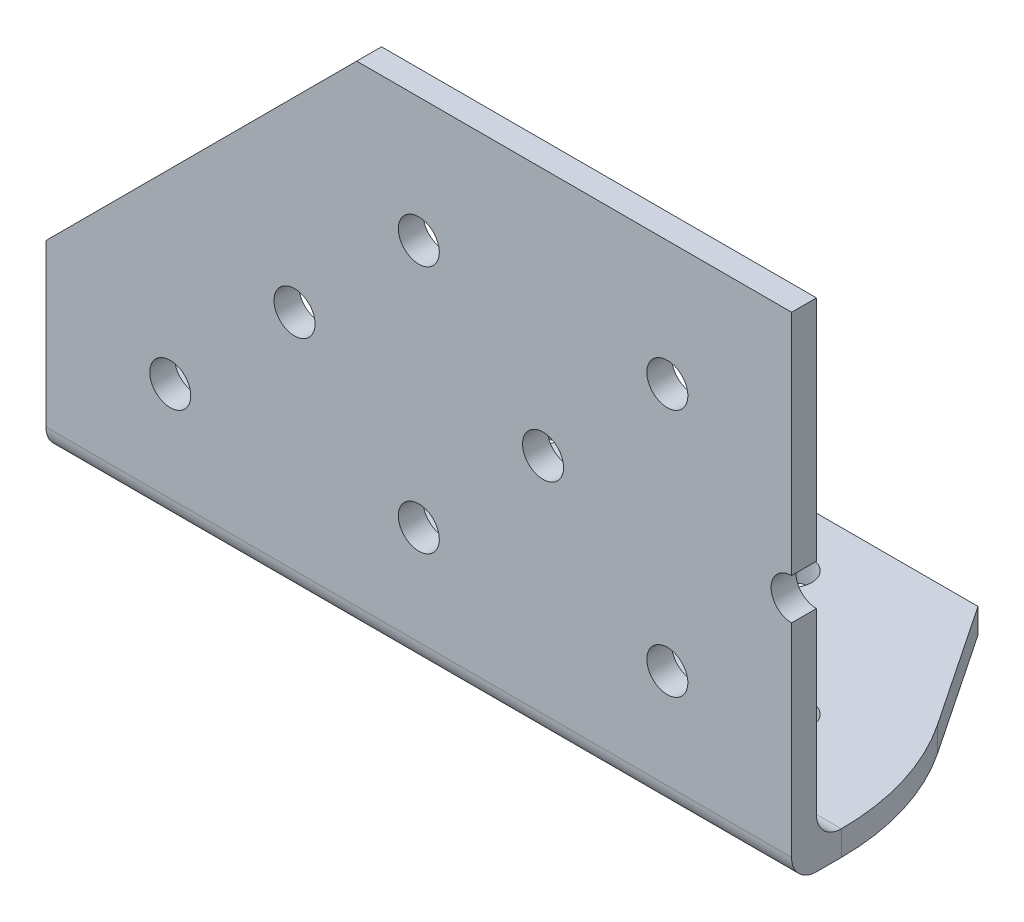
ISO-10303-21;
HEADER;
FILE_DESCRIPTION(('STEP AP214'),'2;1');
FILE_NAME('part.step','',(''),(''),'','','');
FILE_SCHEMA(('AUTOMOTIVE_DESIGN { 1 0 10303 214 1 1 1 1 }'));
ENDSEC;
DATA;
#1=APPLICATION_CONTEXT('core data for automotive mechanical design processes');
#2=APPLICATION_PROTOCOL_DEFINITION('international standard','automotive_design',2000,#1);
#3=PRODUCT_CONTEXT('',#1,'mechanical');
#4=PRODUCT('Part','Part','',(#3));
#5=PRODUCT_RELATED_PRODUCT_CATEGORY('part','',(#4));
#6=PRODUCT_DEFINITION_FORMATION('','',#4);
#7=PRODUCT_DEFINITION_CONTEXT('part definition',#1,'design');
#8=PRODUCT_DEFINITION('design','',#6,#7);
#9=PRODUCT_DEFINITION_SHAPE('','',#8);
#10=(LENGTH_UNIT() NAMED_UNIT(*) SI_UNIT(.MILLI.,.METRE.));
#11=(NAMED_UNIT(*) PLANE_ANGLE_UNIT() SI_UNIT($,.RADIAN.));
#12=(NAMED_UNIT(*) SI_UNIT($,.STERADIAN.) SOLID_ANGLE_UNIT());
#13=UNCERTAINTY_MEASURE_WITH_UNIT(LENGTH_MEASURE(1.E-05),#10,'distance_accuracy_value','');
#14=(GEOMETRIC_REPRESENTATION_CONTEXT(3) GLOBAL_UNCERTAINTY_ASSIGNED_CONTEXT((#13)) GLOBAL_UNIT_ASSIGNED_CONTEXT((#10,
#11,#12)) REPRESENTATION_CONTEXT('',''));
#15=CARTESIAN_POINT('',(0.,0.,0.));
#16=DIRECTION('',(0.,0.,1.));
#17=DIRECTION('',(1.,0.,0.));
#18=AXIS2_PLACEMENT_3D('',#15,#16,#17);
#19=CARTESIAN_POINT('',(0.,5.07999999999997,-5.08000000000003));
#20=DIRECTION('',(-1.,0.,0.));
#21=DIRECTION('',(0.,0.,1.));
#22=AXIS2_PLACEMENT_3D('',#19,#20,#21);
#23=PLANE('',#22);
#24=CARTESIAN_POINT('',(0.,5.07999999999997,-5.08000000000003));
#25=DIRECTION('',(-1.,0.,0.));
#26=DIRECTION('',(0.,0.,1.));
#27=AXIS2_PLACEMENT_3D('',#24,#25,#26);
#28=CIRCLE('',#27,2.54);
#29=CARTESIAN_POINT('',(0.,2.53999999999997,-5.08000000000004));
#30=VERTEX_POINT('',#29);
#31=CARTESIAN_POINT('',(0.,5.07999999999997,-2.54000000000003));
#32=VERTEX_POINT('',#31);
#33=EDGE_CURVE('E152',#30,#32,#28,.T.);
#34=ORIENTED_EDGE('',*,*,#33,.F.);
#35=DIRECTION('',(0.,1.,0.));
#36=VECTOR('',#35,1.);
#37=CARTESIAN_POINT('',(0.,0.,-5.08000000000004));
#38=LINE('',#37,#36);
#39=CARTESIAN_POINT('',(0.,0.,-5.08000000000004));
#40=VERTEX_POINT('',#39);
#41=EDGE_CURVE('E139',#40,#30,#38,.T.);
#42=ORIENTED_EDGE('',*,*,#41,.F.);
#43=DIRECTION('',(0.,0.,-1.));
#44=VECTOR('',#43,1.);
#45=CARTESIAN_POINT('',(0.,0.,-50.8));
#46=LINE('',#45,#44);
#47=CARTESIAN_POINT('',(0.,0.,-2.54000000000001));
#48=VERTEX_POINT('',#47);
#49=EDGE_CURVE('E150',#48,#40,#46,.T.);
#50=ORIENTED_EDGE('',*,*,#49,.F.);
#51=CARTESIAN_POINT('',(0.,2.54,-2.54));
#52=DIRECTION('',(1.,0.,0.));
#53=DIRECTION('',(0.,0.,-1.));
#54=AXIS2_PLACEMENT_3D('',#51,#52,#53);
#55=CIRCLE('',#54,2.54);
#56=CARTESIAN_POINT('',(0.,2.54000000000002,0.));
#57=VERTEX_POINT('',#56);
#58=EDGE_CURVE('E159',#57,#48,#55,.T.);
#59=ORIENTED_EDGE('',*,*,#58,.F.);
#60=DIRECTION('',(0.,-1.,0.));
#61=VECTOR('',#60,1.);
#62=CARTESIAN_POINT('',(0.,2.54000000000002,0.));
#63=LINE('',#62,#61);
#64=CARTESIAN_POINT('',(0.,19.05,0.));
#65=VERTEX_POINT('',#64);
#66=EDGE_CURVE('E163',#65,#57,#63,.T.);
#67=ORIENTED_EDGE('',*,*,#66,.F.);
#68=DIRECTION('',(0.,0.,-1.));
#69=VECTOR('',#68,1.);
#70=CARTESIAN_POINT('',(0.,19.05,0.));
#71=LINE('',#70,#69);
#72=CARTESIAN_POINT('',(0.,19.05,-2.54000000000003));
#73=VERTEX_POINT('',#72);
#74=EDGE_CURVE('E202',#65,#73,#71,.T.);
#75=ORIENTED_EDGE('',*,*,#74,.T.);
#76=DIRECTION('',(0.,1.,0.));
#77=VECTOR('',#76,1.);
#78=CARTESIAN_POINT('',(0.,50.8,-2.54000000000002));
#79=LINE('',#78,#77);
#80=EDGE_CURVE('E161',#32,#73,#79,.T.);
#81=ORIENTED_EDGE('',*,*,#80,.F.);
#82=EDGE_LOOP('',(#34,#42,#50,#59,#67,#75,#81));
#83=FACE_BOUND('',#82,.T.);
#84=ADVANCED_FACE('F33',(#83),#23,.T.);
#85=CARTESIAN_POINT('',(76.2,5.07999999999997,-5.08000000000003));
#86=DIRECTION('',(-1.,0.,0.));
#87=DIRECTION('',(0.,0.,1.));
#88=AXIS2_PLACEMENT_3D('',#85,#86,#87);
#89=PLANE('',#88);
#90=DIRECTION('',(0.,1.,0.));
#91=VECTOR('',#90,1.);
#92=CARTESIAN_POINT('',(76.2,0.,-5.08000000000005));
#93=LINE('',#92,#91);
#94=CARTESIAN_POINT('',(76.2,0.,-5.08000000000005));
#95=VERTEX_POINT('',#94);
#96=CARTESIAN_POINT('',(76.2,2.53999999999997,-5.08000000000005));
#97=VERTEX_POINT('',#96);
#98=EDGE_CURVE('E328',#95,#97,#93,.T.);
#99=ORIENTED_EDGE('',*,*,#98,.T.);
#100=CARTESIAN_POINT('',(76.2,5.07999999999997,-5.08000000000003));
#101=DIRECTION('',(-1.,0.,0.));
#102=DIRECTION('',(0.,0.,1.));
#103=AXIS2_PLACEMENT_3D('',#100,#101,#102);
#104=CIRCLE('',#103,2.54);
#105=CARTESIAN_POINT('',(76.2,5.07999999999997,-2.54000000000003));
#106=VERTEX_POINT('',#105);
#107=EDGE_CURVE('E300',#97,#106,#104,.T.);
#108=ORIENTED_EDGE('',*,*,#107,.T.);
#109=DIRECTION('',(0.,1.,0.));
#110=VECTOR('',#109,1.);
#111=CARTESIAN_POINT('',(76.2,50.8,-2.54000000000002));
#112=LINE('',#111,#110);
#113=CARTESIAN_POINT('',(76.2,23.3045,-2.54000000000003));
#114=VERTEX_POINT('',#113);
#115=EDGE_CURVE('E174',#106,#114,#112,.T.);
#116=ORIENTED_EDGE('',*,*,#115,.T.);
#117=DIRECTION('',(0.,0.,-1.));
#118=VECTOR('',#117,1.);
#119=CARTESIAN_POINT('',(76.2,23.3045,0.));
#120=LINE('',#119,#118);
#121=CARTESIAN_POINT('',(76.2,23.3045,0.));
#122=VERTEX_POINT('',#121);
#123=EDGE_CURVE('E216',#114,#122,#120,.F.);
#124=ORIENTED_EDGE('',*,*,#123,.T.);
#125=DIRECTION('',(0.,-1.,0.));
#126=VECTOR('',#125,1.);
#127=CARTESIAN_POINT('',(76.2,2.54000000000002,0.));
#128=LINE('',#127,#126);
#129=CARTESIAN_POINT('',(76.2,2.54000000000002,0.));
#130=VERTEX_POINT('',#129);
#131=EDGE_CURVE('E293',#122,#130,#128,.T.);
#132=ORIENTED_EDGE('',*,*,#131,.T.);
#133=CARTESIAN_POINT('',(76.2,2.54,-2.54));
#134=DIRECTION('',(1.,0.,0.));
#135=DIRECTION('',(0.,0.,-1.));
#136=AXIS2_PLACEMENT_3D('',#133,#134,#135);
#137=CIRCLE('',#136,2.54);
#138=CARTESIAN_POINT('',(76.2,0.,-2.54000000000001));
#139=VERTEX_POINT('',#138);
#140=EDGE_CURVE('E295',#130,#139,#137,.T.);
#141=ORIENTED_EDGE('',*,*,#140,.T.);
#142=DIRECTION('',(0.,0.,-1.));
#143=VECTOR('',#142,1.);
#144=CARTESIAN_POINT('',(76.2,0.,-50.8));
#145=LINE('',#144,#143);
#146=EDGE_CURVE('E297',#139,#95,#145,.T.);
#147=ORIENTED_EDGE('',*,*,#146,.T.);
#148=EDGE_LOOP('',(#99,#108,#116,#124,#132,#141,#147));
#149=FACE_BOUND('',#148,.T.);
#150=ADVANCED_FACE('F311',(#149),#89,.F.);
#151=CARTESIAN_POINT('',(76.2,50.8,0.));
#152=VERTEX_POINT('',#151);
#153=CARTESIAN_POINT('',(76.2,27.4955,0.));
#154=VERTEX_POINT('',#153);
#155=EDGE_CURVE('E192',#152,#154,#128,.T.);
#156=ORIENTED_EDGE('',*,*,#155,.T.);
#157=DIRECTION('',(0.,0.,-1.));
#158=VECTOR('',#157,1.);
#159=CARTESIAN_POINT('',(76.2,27.4955,0.));
#160=LINE('',#159,#158);
#161=CARTESIAN_POINT('',(76.2,27.4955,-2.54000000000003));
#162=VERTEX_POINT('',#161);
#163=EDGE_CURVE('E241',#154,#162,#160,.T.);
#164=ORIENTED_EDGE('',*,*,#163,.T.);
#165=CARTESIAN_POINT('',(76.2,50.8,-2.54000000000002));
#166=VERTEX_POINT('',#165);
#167=EDGE_CURVE('E302',#162,#166,#112,.T.);
#168=ORIENTED_EDGE('',*,*,#167,.T.);
#169=DIRECTION('',(0.,0.,1.));
#170=VECTOR('',#169,1.);
#171=CARTESIAN_POINT('',(76.2,50.8,0.));
#172=LINE('',#171,#170);
#173=EDGE_CURVE('E169',#166,#152,#172,.T.);
#174=ORIENTED_EDGE('',*,*,#173,.T.);
#175=EDGE_LOOP('',(#156,#164,#168,#174));
#176=FACE_BOUND('',#175,.T.);
#177=ADVANCED_FACE('F314',(#176),#89,.F.);
#178=CARTESIAN_POINT('',(76.2,50.8,0.));
#179=DIRECTION('',(0.,-1.,0.));
#180=DIRECTION('',(0.,0.,-1.));
#181=AXIS2_PLACEMENT_3D('',#178,#179,#180);
#182=PLANE('',#181);
#183=DIRECTION('',(-1.,0.,0.));
#184=VECTOR('',#183,1.);
#185=CARTESIAN_POINT('',(76.2,50.8,-2.54000000000002));
#186=LINE('',#185,#184);
#187=CARTESIAN_POINT('',(31.75,50.8,-2.54000000000002));
#188=VERTEX_POINT('',#187);
#189=EDGE_CURVE('E170',#166,#188,#186,.T.);
#190=ORIENTED_EDGE('',*,*,#189,.T.);
#191=DIRECTION('',(0.,0.,-1.));
#192=VECTOR('',#191,1.);
#193=CARTESIAN_POINT('',(31.75,50.8,0.));
#194=LINE('',#193,#192);
#195=CARTESIAN_POINT('',(31.75,50.8,0.));
#196=VERTEX_POINT('',#195);
#197=EDGE_CURVE('E197',#196,#188,#194,.T.);
#198=ORIENTED_EDGE('',*,*,#197,.F.);
#199=DIRECTION('',(-1.,0.,0.));
#200=VECTOR('',#199,1.);
#201=CARTESIAN_POINT('',(76.2,50.8,0.));
#202=LINE('',#201,#200);
#203=EDGE_CURVE('E41',#152,#196,#202,.T.);
#204=ORIENTED_EDGE('',*,*,#203,.F.);
#205=ORIENTED_EDGE('',*,*,#173,.F.);
#206=EDGE_LOOP('',(#190,#198,#204,#205));
#207=FACE_BOUND('',#206,.T.);
#208=ADVANCED_FACE('F35',(#207),#182,.F.);
#209=CARTESIAN_POINT('',(76.2,2.54000000000002,0.));
#210=DIRECTION('',(0.,0.,-1.));
#211=DIRECTION('',(-1.,0.,0.));
#212=AXIS2_PLACEMENT_3D('',#209,#210,#211);
#213=PLANE('',#212);
#214=CARTESIAN_POINT('',(38.1,12.7,0.));
#215=DIRECTION('',(0.,0.,-1.));
#216=DIRECTION('',(0.,1.,0.));
#217=AXIS2_PLACEMENT_3D('',#214,#215,#216);
#218=CIRCLE('',#217,2.0955);
#219=CARTESIAN_POINT('',(38.1,14.7955,0.));
#220=VERTEX_POINT('',#219);
#221=EDGE_CURVE('E213',#220,#220,#218,.T.);
#222=ORIENTED_EDGE('',*,*,#221,.T.);
#223=EDGE_LOOP('',(#222));
#224=FACE_BOUND('',#223,.T.);
#225=CARTESIAN_POINT('',(50.8,25.4,0.));
#226=DIRECTION('',(0.,0.,-1.));
#227=DIRECTION('',(0.,1.,0.));
#228=AXIS2_PLACEMENT_3D('',#225,#226,#227);
#229=CIRCLE('',#228,2.0955);
#230=CARTESIAN_POINT('',(50.8,27.4955,0.));
#231=VERTEX_POINT('',#230);
#232=EDGE_CURVE('E220',#231,#231,#229,.T.);
#233=ORIENTED_EDGE('',*,*,#232,.T.);
#234=EDGE_LOOP('',(#233));
#235=FACE_BOUND('',#234,.T.);
#236=CARTESIAN_POINT('',(63.5,38.1,0.));
#237=DIRECTION('',(0.,0.,-1.));
#238=DIRECTION('',(0.,1.,0.));
#239=AXIS2_PLACEMENT_3D('',#236,#237,#238);
#240=CIRCLE('',#239,2.0955);
#241=CARTESIAN_POINT('',(63.5,40.1955,0.));
#242=VERTEX_POINT('',#241);
#243=EDGE_CURVE('E226',#242,#242,#240,.T.);
#244=ORIENTED_EDGE('',*,*,#243,.T.);
#245=EDGE_LOOP('',(#244));
#246=FACE_BOUND('',#245,.T.);
#247=CARTESIAN_POINT('',(63.5,12.7,0.));
#248=DIRECTION('',(0.,0.,-1.));
#249=DIRECTION('',(0.,1.,0.));
#250=AXIS2_PLACEMENT_3D('',#247,#248,#249);
#251=CIRCLE('',#250,2.0955);
#252=CARTESIAN_POINT('',(63.5,14.7955,0.));
#253=VERTEX_POINT('',#252);
#254=EDGE_CURVE('E232',#253,#253,#251,.T.);
#255=ORIENTED_EDGE('',*,*,#254,.T.);
#256=EDGE_LOOP('',(#255));
#257=FACE_BOUND('',#256,.T.);
#258=CARTESIAN_POINT('',(38.1,38.1,0.));
#259=DIRECTION('',(0.,0.,-1.));
#260=DIRECTION('',(0.,1.,0.));
#261=AXIS2_PLACEMENT_3D('',#258,#259,#260);
#262=CIRCLE('',#261,2.0955);
#263=CARTESIAN_POINT('',(38.1,40.1955,0.));
#264=VERTEX_POINT('',#263);
#265=EDGE_CURVE('E245',#264,#264,#262,.T.);
#266=ORIENTED_EDGE('',*,*,#265,.T.);
#267=EDGE_LOOP('',(#266));
#268=FACE_BOUND('',#267,.T.);
#269=CARTESIAN_POINT('',(12.7,12.7,0.));
#270=DIRECTION('',(0.,0.,-1.));
#271=DIRECTION('',(0.,1.,0.));
#272=AXIS2_PLACEMENT_3D('',#269,#270,#271);
#273=CIRCLE('',#272,2.0955);
#274=CARTESIAN_POINT('',(12.7,14.7955,0.));
#275=VERTEX_POINT('',#274);
#276=EDGE_CURVE('E251',#275,#275,#273,.T.);
#277=ORIENTED_EDGE('',*,*,#276,.T.);
#278=EDGE_LOOP('',(#277));
#279=FACE_BOUND('',#278,.T.);
#280=CARTESIAN_POINT('',(25.4,25.4,0.));
#281=DIRECTION('',(0.,0.,-1.));
#282=DIRECTION('',(0.,1.,0.));
#283=AXIS2_PLACEMENT_3D('',#280,#281,#282);
#284=CIRCLE('',#283,2.0955);
#285=CARTESIAN_POINT('',(25.4,27.4955,0.));
#286=VERTEX_POINT('',#285);
#287=EDGE_CURVE('E258',#286,#286,#284,.T.);
#288=ORIENTED_EDGE('',*,*,#287,.T.);
#289=EDGE_LOOP('',(#288));
#290=FACE_BOUND('',#289,.T.);
#291=ORIENTED_EDGE('',*,*,#203,.T.);
#292=DIRECTION('',(-0.707106781186547,-0.707106781186548,0.));
#293=VECTOR('',#292,1.);
#294=CARTESIAN_POINT('',(0.,19.05,0.));
#295=LINE('',#294,#293);
#296=EDGE_CURVE('E188',#196,#65,#295,.T.);
#297=ORIENTED_EDGE('',*,*,#296,.T.);
#298=ORIENTED_EDGE('',*,*,#66,.T.);
#299=DIRECTION('',(-1.,0.,0.));
#300=VECTOR('',#299,1.);
#301=CARTESIAN_POINT('',(76.2,2.54000000000002,0.));
#302=LINE('',#301,#300);
#303=EDGE_CURVE('E181',#130,#57,#302,.T.);
#304=ORIENTED_EDGE('',*,*,#303,.F.);
#305=ORIENTED_EDGE('',*,*,#131,.F.);
#306=CARTESIAN_POINT('',(76.2,25.4,0.));
#307=DIRECTION('',(0.,0.,-1.));
#308=DIRECTION('',(0.,1.,0.));
#309=AXIS2_PLACEMENT_3D('',#306,#307,#308);
#310=CIRCLE('',#309,2.0955);
#311=EDGE_CURVE('E211',#122,#154,#310,.T.);
#312=ORIENTED_EDGE('',*,*,#311,.T.);
#313=ORIENTED_EDGE('',*,*,#155,.F.);
#314=EDGE_LOOP('',(#291,#297,#298,#304,#305,#312,#313));
#315=FACE_BOUND('',#314,.T.);
#316=ADVANCED_FACE('F187',(#224,#235,#246,#257,#268,#279,#290,#315),#213,.F.);
#317=CARTESIAN_POINT('',(76.2,2.54,-2.54));
#318=DIRECTION('',(-1.,0.,0.));
#319=DIRECTION('',(0.,0.,1.));
#320=AXIS2_PLACEMENT_3D('',#317,#318,#319);
#321=CYLINDRICAL_SURFACE('',#320,2.54);
#322=ORIENTED_EDGE('',*,*,#58,.T.);
#323=DIRECTION('',(-1.,0.,0.));
#324=VECTOR('',#323,1.);
#325=CARTESIAN_POINT('',(76.2,0.,-2.54000000000001));
#326=LINE('',#325,#324);
#327=EDGE_CURVE('E158',#139,#48,#326,.T.);
#328=ORIENTED_EDGE('',*,*,#327,.F.);
#329=ORIENTED_EDGE('',*,*,#140,.F.);
#330=ORIENTED_EDGE('',*,*,#303,.T.);
#331=EDGE_LOOP('',(#322,#328,#329,#330));
#332=FACE_BOUND('',#331,.T.);
#333=ADVANCED_FACE('F308',(#332),#321,.T.);
#334=CARTESIAN_POINT('',(76.2,0.,-50.8));
#335=DIRECTION('',(0.,1.,0.));
#336=DIRECTION('',(0.,0.,1.));
#337=AXIS2_PLACEMENT_3D('',#334,#335,#336);
#338=PLANE('',#337);
#339=CARTESIAN_POINT('',(38.1,0.,-12.6619));
#340=DIRECTION('',(0.,1.,0.));
#341=DIRECTION('',(0.,0.,1.));
#342=AXIS2_PLACEMENT_3D('',#339,#340,#341);
#343=CIRCLE('',#342,2.0955);
#344=CARTESIAN_POINT('',(38.1,0.,-10.5664));
#345=VERTEX_POINT('',#344);
#346=EDGE_CURVE('E263',#345,#345,#343,.T.);
#347=ORIENTED_EDGE('',*,*,#346,.T.);
#348=EDGE_LOOP('',(#347));
#349=FACE_BOUND('',#348,.T.);
#350=CARTESIAN_POINT('',(50.8,0.,-25.3619));
#351=DIRECTION('',(0.,1.,0.));
#352=DIRECTION('',(0.,0.,1.));
#353=AXIS2_PLACEMENT_3D('',#350,#351,#352);
#354=CIRCLE('',#353,2.0955);
#355=CARTESIAN_POINT('',(50.8,0.,-23.2664));
#356=VERTEX_POINT('',#355);
#357=EDGE_CURVE('E270',#356,#356,#354,.T.);
#358=ORIENTED_EDGE('',*,*,#357,.T.);
#359=EDGE_LOOP('',(#358));
#360=FACE_BOUND('',#359,.T.);
#361=CARTESIAN_POINT('',(63.5,0.,-12.6619));
#362=DIRECTION('',(0.,1.,0.));
#363=DIRECTION('',(0.,0.,1.));
#364=AXIS2_PLACEMENT_3D('',#361,#362,#363);
#365=CIRCLE('',#364,2.0955);
#366=CARTESIAN_POINT('',(63.5,0.,-10.5664));
#367=VERTEX_POINT('',#366);
#368=EDGE_CURVE('E276',#367,#367,#365,.T.);
#369=ORIENTED_EDGE('',*,*,#368,.T.);
#370=EDGE_LOOP('',(#369));
#371=FACE_BOUND('',#370,.T.);
#372=CARTESIAN_POINT('',(12.7,0.,-12.6619));
#373=DIRECTION('',(0.,1.,0.));
#374=DIRECTION('',(0.,0.,1.));
#375=AXIS2_PLACEMENT_3D('',#372,#373,#374);
#376=CIRCLE('',#375,2.0955);
#377=CARTESIAN_POINT('',(12.7,0.,-10.5664));
#378=VERTEX_POINT('',#377);
#379=EDGE_CURVE('E281',#378,#378,#376,.T.);
#380=ORIENTED_EDGE('',*,*,#379,.T.);
#381=EDGE_LOOP('',(#380));
#382=FACE_BOUND('',#381,.T.);
#383=CARTESIAN_POINT('',(25.4,0.,-25.3619));
#384=DIRECTION('',(0.,1.,0.));
#385=DIRECTION('',(0.,0.,1.));
#386=AXIS2_PLACEMENT_3D('',#383,#384,#385);
#387=CIRCLE('',#386,2.0955);
#388=CARTESIAN_POINT('',(25.4,0.,-23.2664));
#389=VERTEX_POINT('',#388);
#390=EDGE_CURVE('E287',#389,#389,#387,.T.);
#391=ORIENTED_EDGE('',*,*,#390,.T.);
#392=EDGE_LOOP('',(#391));
#393=FACE_BOUND('',#392,.T.);
#394=CARTESIAN_POINT('',(25.4,0.,-5.08000000000005));
#395=DIRECTION('',(0.,-1.,0.));
#396=DIRECTION('',(0.,0.,-1.));
#397=AXIS2_PLACEMENT_3D('',#394,#395,#396);
#398=CIRCLE('',#397,25.4);
#399=CARTESIAN_POINT('',(4.3024508886765,0.,-19.2240242327032));
#400=VERTEX_POINT('',#399);
#401=EDGE_CURVE('E136',#40,#400,#398,.T.);
#402=ORIENTED_EDGE('',*,*,#401,.T.);
#403=DIRECTION('',(0.556851347744217,0.,-0.830612169737146));
#404=VECTOR('',#403,1.);
#405=CARTESIAN_POINT('',(12.7,0.,-31.75));
#406=LINE('',#405,#404);
#407=CARTESIAN_POINT('',(12.7,0.,-31.75));
#408=VERTEX_POINT('',#407);
#409=EDGE_CURVE('E144',#400,#408,#406,.T.);
#410=ORIENTED_EDGE('',*,*,#409,.T.);
#411=DIRECTION('',(1.,0.,0.));
#412=VECTOR('',#411,1.);
#413=CARTESIAN_POINT('',(76.2,0.,-31.75));
#414=LINE('',#413,#412);
#415=CARTESIAN_POINT('',(63.5,0.,-31.75));
#416=VERTEX_POINT('',#415);
#417=EDGE_CURVE('E56',#408,#416,#414,.T.);
#418=ORIENTED_EDGE('',*,*,#417,.T.);
#419=DIRECTION('',(0.556851347744217,0.,0.830612169737146));
#420=VECTOR('',#419,1.);
#421=CARTESIAN_POINT('',(63.5,0.,-31.75));
#422=LINE('',#421,#420);
#423=CARTESIAN_POINT('',(71.8975491113235,0.,-19.2240242327031));
#424=VERTEX_POINT('',#423);
#425=EDGE_CURVE('E331',#416,#424,#422,.T.);
#426=ORIENTED_EDGE('',*,*,#425,.T.);
#427=CARTESIAN_POINT('',(50.8,0.,-5.08000000000005));
#428=DIRECTION('',(0.,-1.,0.));
#429=DIRECTION('',(0.,0.,1.));
#430=AXIS2_PLACEMENT_3D('',#427,#428,#429);
#431=CIRCLE('',#430,25.4);
#432=EDGE_CURVE('E337',#424,#95,#431,.T.);
#433=ORIENTED_EDGE('',*,*,#432,.T.);
#434=ORIENTED_EDGE('',*,*,#146,.F.);
#435=ORIENTED_EDGE('',*,*,#327,.T.);
#436=ORIENTED_EDGE('',*,*,#49,.T.);
#437=EDGE_LOOP('',(#402,#410,#418,#426,#433,#434,#435,#436));
#438=FACE_BOUND('',#437,.T.);
#439=ADVANCED_FACE('F155',(#349,#360,#371,#382,#393,#438),#338,.F.);
#440=CARTESIAN_POINT('',(76.2,2.53999999999997,-5.08000000000005));
#441=DIRECTION('',(0.,-1.,0.));
#442=DIRECTION('',(0.,0.,-1.));
#443=AXIS2_PLACEMENT_3D('',#440,#441,#442);
#444=PLANE('',#443);
#445=CARTESIAN_POINT('',(38.1,2.53999999999997,-12.6619));
#446=DIRECTION('',(0.,1.,0.));
#447=DIRECTION('',(0.,0.,1.));
#448=AXIS2_PLACEMENT_3D('',#445,#446,#447);
#449=CIRCLE('',#448,2.0955);
#450=CARTESIAN_POINT('',(38.1,2.53999999999997,-10.5664));
#451=VERTEX_POINT('',#450);
#452=EDGE_CURVE('E267',#451,#451,#449,.T.);
#453=ORIENTED_EDGE('',*,*,#452,.F.);
#454=EDGE_LOOP('',(#453));
#455=FACE_BOUND('',#454,.T.);
#456=CARTESIAN_POINT('',(50.8,2.53999999999997,-25.3619));
#457=DIRECTION('',(0.,1.,0.));
#458=DIRECTION('',(0.,0.,1.));
#459=AXIS2_PLACEMENT_3D('',#456,#457,#458);
#460=CIRCLE('',#459,2.0955);
#461=CARTESIAN_POINT('',(50.8,2.53999999999997,-23.2664));
#462=VERTEX_POINT('',#461);
#463=EDGE_CURVE('E273',#462,#462,#460,.T.);
#464=ORIENTED_EDGE('',*,*,#463,.F.);
#465=EDGE_LOOP('',(#464));
#466=FACE_BOUND('',#465,.T.);
#467=CARTESIAN_POINT('',(63.5,2.53999999999997,-12.6619));
#468=DIRECTION('',(0.,1.,0.));
#469=DIRECTION('',(0.,0.,1.));
#470=AXIS2_PLACEMENT_3D('',#467,#468,#469);
#471=CIRCLE('',#470,2.0955);
#472=CARTESIAN_POINT('',(63.5,2.53999999999997,-10.5664));
#473=VERTEX_POINT('',#472);
#474=EDGE_CURVE('E254',#473,#473,#471,.T.);
#475=ORIENTED_EDGE('',*,*,#474,.F.);
#476=EDGE_LOOP('',(#475));
#477=FACE_BOUND('',#476,.T.);
#478=CARTESIAN_POINT('',(12.7,2.53999999999997,-12.6619));
#479=DIRECTION('',(0.,1.,0.));
#480=DIRECTION('',(0.,0.,1.));
#481=AXIS2_PLACEMENT_3D('',#478,#479,#480);
#482=CIRCLE('',#481,2.0955);
#483=CARTESIAN_POINT('',(12.7,2.53999999999997,-10.5664));
#484=VERTEX_POINT('',#483);
#485=EDGE_CURVE('E284',#484,#484,#482,.T.);
#486=ORIENTED_EDGE('',*,*,#485,.F.);
#487=EDGE_LOOP('',(#486));
#488=FACE_BOUND('',#487,.T.);
#489=CARTESIAN_POINT('',(25.4,2.53999999999997,-25.3619));
#490=DIRECTION('',(0.,1.,0.));
#491=DIRECTION('',(0.,0.,1.));
#492=AXIS2_PLACEMENT_3D('',#489,#490,#491);
#493=CIRCLE('',#492,2.0955);
#494=CARTESIAN_POINT('',(25.4,2.53999999999997,-23.2664));
#495=VERTEX_POINT('',#494);
#496=EDGE_CURVE('E266',#495,#495,#493,.T.);
#497=ORIENTED_EDGE('',*,*,#496,.F.);
#498=EDGE_LOOP('',(#497));
#499=FACE_BOUND('',#498,.T.);
#500=DIRECTION('',(1.,0.,0.));
#501=VECTOR('',#500,1.);
#502=CARTESIAN_POINT('',(76.2,2.53999999999997,-31.75));
#503=LINE('',#502,#501);
#504=CARTESIAN_POINT('',(12.7,2.53999999999997,-31.75));
#505=VERTEX_POINT('',#504);
#506=CARTESIAN_POINT('',(63.5,2.53999999999997,-31.75));
#507=VERTEX_POINT('',#506);
#508=EDGE_CURVE('E201',#505,#507,#503,.T.);
#509=ORIENTED_EDGE('',*,*,#508,.F.);
#510=DIRECTION('',(-0.556851347744217,0.,0.830612169737146));
#511=VECTOR('',#510,1.);
#512=CARTESIAN_POINT('',(20.0546888016917,2.53999999999997,-42.7204215461838));
#513=LINE('',#512,#511);
#514=CARTESIAN_POINT('',(4.3024508886765,2.53999999999997,-19.2240242327032));
#515=VERTEX_POINT('',#514);
#516=EDGE_CURVE('E48',#505,#515,#513,.T.);
#517=ORIENTED_EDGE('',*,*,#516,.T.);
#518=CARTESIAN_POINT('',(25.4,2.53999999999997,-5.08000000000005));
#519=DIRECTION('',(0.,-1.,0.));
#520=DIRECTION('',(0.,0.,-1.));
#521=AXIS2_PLACEMENT_3D('',#518,#519,#520);
#522=CIRCLE('',#521,25.4);
#523=EDGE_CURVE('E340',#515,#30,#522,.F.);
#524=ORIENTED_EDGE('',*,*,#523,.T.);
#525=DIRECTION('',(-1.,0.,0.));
#526=VECTOR('',#525,1.);
#527=CARTESIAN_POINT('',(76.2,2.53999999999997,-5.08000000000005));
#528=LINE('',#527,#526);
#529=EDGE_CURVE('E177',#97,#30,#528,.T.);
#530=ORIENTED_EDGE('',*,*,#529,.F.);
#531=CARTESIAN_POINT('',(50.8,2.53999999999997,-5.08000000000005));
#532=DIRECTION('',(0.,-1.,0.));
#533=DIRECTION('',(0.,0.,-1.));
#534=AXIS2_PLACEMENT_3D('',#531,#532,#533);
#535=CIRCLE('',#534,25.4);
#536=CARTESIAN_POINT('',(71.8975491113235,2.53999999999997,-19.2240242327031));
#537=VERTEX_POINT('',#536);
#538=EDGE_CURVE('E318',#97,#537,#535,.F.);
#539=ORIENTED_EDGE('',*,*,#538,.T.);
#540=DIRECTION('',(-0.556851347744217,0.,-0.830612169737146));
#541=VECTOR('',#540,1.);
#542=CARTESIAN_POINT('',(79.7736680678311,2.53999999999997,-7.47582557596284));
#543=LINE('',#542,#541);
#544=EDGE_CURVE('E320',#537,#507,#543,.T.);
#545=ORIENTED_EDGE('',*,*,#544,.T.);
#546=EDGE_LOOP('',(#509,#517,#524,#530,#539,#545));
#547=FACE_BOUND('',#546,.T.);
#548=ADVANCED_FACE('F352',(#455,#466,#477,#488,#499,#547),#444,.F.);
#549=CARTESIAN_POINT('',(76.2,5.07999999999997,-5.08000000000003));
#550=DIRECTION('',(-1.,0.,0.));
#551=DIRECTION('',(0.,0.,1.));
#552=AXIS2_PLACEMENT_3D('',#549,#550,#551);
#553=CYLINDRICAL_SURFACE('',#552,2.54);
#554=ORIENTED_EDGE('',*,*,#33,.T.);
#555=DIRECTION('',(-1.,0.,0.));
#556=VECTOR('',#555,1.);
#557=CARTESIAN_POINT('',(76.2,5.07999999999997,-2.54000000000003));
#558=LINE('',#557,#556);
#559=EDGE_CURVE('E173',#106,#32,#558,.T.);
#560=ORIENTED_EDGE('',*,*,#559,.F.);
#561=ORIENTED_EDGE('',*,*,#107,.F.);
#562=ORIENTED_EDGE('',*,*,#529,.T.);
#563=EDGE_LOOP('',(#554,#560,#561,#562));
#564=FACE_BOUND('',#563,.T.);
#565=ADVANCED_FACE('F355',(#564),#553,.F.);
#566=CARTESIAN_POINT('',(76.2,50.8,-2.54000000000002));
#567=DIRECTION('',(0.,0.,1.));
#568=DIRECTION('',(0.,-1.,0.));
#569=AXIS2_PLACEMENT_3D('',#566,#567,#568);
#570=PLANE('',#569);
#571=CARTESIAN_POINT('',(38.1,12.7,-2.54000000000003));
#572=DIRECTION('',(0.,0.,-1.));
#573=DIRECTION('',(0.,1.,0.));
#574=AXIS2_PLACEMENT_3D('',#571,#572,#573);
#575=CIRCLE('',#574,2.0955);
#576=CARTESIAN_POINT('',(38.1,14.7955,-2.54000000000003));
#577=VERTEX_POINT('',#576);
#578=EDGE_CURVE('E217',#577,#577,#575,.T.);
#579=ORIENTED_EDGE('',*,*,#578,.F.);
#580=EDGE_LOOP('',(#579));
#581=FACE_BOUND('',#580,.T.);
#582=CARTESIAN_POINT('',(50.8,25.4,-2.54000000000003));
#583=DIRECTION('',(0.,0.,-1.));
#584=DIRECTION('',(0.,1.,0.));
#585=AXIS2_PLACEMENT_3D('',#582,#583,#584);
#586=CIRCLE('',#585,2.0955);
#587=CARTESIAN_POINT('',(50.8,27.4955,-2.54000000000003));
#588=VERTEX_POINT('',#587);
#589=EDGE_CURVE('E223',#588,#588,#586,.T.);
#590=ORIENTED_EDGE('',*,*,#589,.F.);
#591=EDGE_LOOP('',(#590));
#592=FACE_BOUND('',#591,.T.);
#593=CARTESIAN_POINT('',(63.5,38.1,-2.54000000000003));
#594=DIRECTION('',(0.,0.,-1.));
#595=DIRECTION('',(0.,1.,0.));
#596=AXIS2_PLACEMENT_3D('',#593,#594,#595);
#597=CIRCLE('',#596,2.0955);
#598=CARTESIAN_POINT('',(63.5,40.1955,-2.54000000000003));
#599=VERTEX_POINT('',#598);
#600=EDGE_CURVE('E229',#599,#599,#597,.T.);
#601=ORIENTED_EDGE('',*,*,#600,.F.);
#602=EDGE_LOOP('',(#601));
#603=FACE_BOUND('',#602,.T.);
#604=CARTESIAN_POINT('',(63.5,12.7,-2.54000000000003));
#605=DIRECTION('',(0.,0.,-1.));
#606=DIRECTION('',(0.,1.,0.));
#607=AXIS2_PLACEMENT_3D('',#604,#605,#606);
#608=CIRCLE('',#607,2.0955);
#609=CARTESIAN_POINT('',(63.5,14.7955,-2.54000000000003));
#610=VERTEX_POINT('',#609);
#611=EDGE_CURVE('E235',#610,#610,#608,.T.);
#612=ORIENTED_EDGE('',*,*,#611,.F.);
#613=EDGE_LOOP('',(#612));
#614=FACE_BOUND('',#613,.T.);
#615=CARTESIAN_POINT('',(38.1,38.1,-2.54000000000003));
#616=DIRECTION('',(0.,0.,-1.));
#617=DIRECTION('',(0.,1.,0.));
#618=AXIS2_PLACEMENT_3D('',#615,#616,#617);
#619=CIRCLE('',#618,2.0955);
#620=CARTESIAN_POINT('',(38.1,40.1955,-2.54000000000003));
#621=VERTEX_POINT('',#620);
#622=EDGE_CURVE('E244',#621,#621,#619,.T.);
#623=ORIENTED_EDGE('',*,*,#622,.F.);
#624=EDGE_LOOP('',(#623));
#625=FACE_BOUND('',#624,.T.);
#626=CARTESIAN_POINT('',(12.7,12.7,-2.54000000000003));
#627=DIRECTION('',(0.,0.,-1.));
#628=DIRECTION('',(0.,1.,0.));
#629=AXIS2_PLACEMENT_3D('',#626,#627,#628);
#630=CIRCLE('',#629,2.0955);
#631=CARTESIAN_POINT('',(12.7,14.7955,-2.54000000000003));
#632=VERTEX_POINT('',#631);
#633=EDGE_CURVE('E255',#632,#632,#630,.T.);
#634=ORIENTED_EDGE('',*,*,#633,.F.);
#635=EDGE_LOOP('',(#634));
#636=FACE_BOUND('',#635,.T.);
#637=CARTESIAN_POINT('',(25.4,25.4,-2.54000000000003));
#638=DIRECTION('',(0.,0.,-1.));
#639=DIRECTION('',(0.,1.,0.));
#640=AXIS2_PLACEMENT_3D('',#637,#638,#639);
#641=CIRCLE('',#640,2.0955);
#642=CARTESIAN_POINT('',(25.4,27.4955,-2.54000000000003));
#643=VERTEX_POINT('',#642);
#644=EDGE_CURVE('E248',#643,#643,#641,.T.);
#645=ORIENTED_EDGE('',*,*,#644,.F.);
#646=EDGE_LOOP('',(#645));
#647=FACE_BOUND('',#646,.T.);
#648=ORIENTED_EDGE('',*,*,#80,.T.);
#649=DIRECTION('',(-0.707106781186547,-0.707106781186548,0.));
#650=VECTOR('',#649,1.);
#651=CARTESIAN_POINT('',(0.,19.05,-2.54000000000003));
#652=LINE('',#651,#650);
#653=EDGE_CURVE('E208',#188,#73,#652,.T.);
#654=ORIENTED_EDGE('',*,*,#653,.F.);
#655=ORIENTED_EDGE('',*,*,#189,.F.);
#656=ORIENTED_EDGE('',*,*,#167,.F.);
#657=CARTESIAN_POINT('',(76.2,25.4,-2.54000000000003));
#658=DIRECTION('',(0.,0.,1.));
#659=DIRECTION('',(0.,-1.,0.));
#660=AXIS2_PLACEMENT_3D('',#657,#658,#659);
#661=CIRCLE('',#660,2.0955);
#662=EDGE_CURVE('E11',#162,#114,#661,.T.);
#663=ORIENTED_EDGE('',*,*,#662,.T.);
#664=ORIENTED_EDGE('',*,*,#115,.F.);
#665=ORIENTED_EDGE('',*,*,#559,.T.);
#666=EDGE_LOOP('',(#648,#654,#655,#656,#663,#664,#665));
#667=FACE_BOUND('',#666,.T.);
#668=ADVANCED_FACE('F317',(#581,#592,#603,#614,#625,#636,#647,#667),#570,.F.);
#669=CARTESIAN_POINT('',(25.4,0.,-25.3619));
#670=DIRECTION('',(0.,1.,0.));
#671=DIRECTION('',(0.,0.,1.));
#672=AXIS2_PLACEMENT_3D('',#669,#670,#671);
#673=CYLINDRICAL_SURFACE('',#672,2.0955);
#674=ORIENTED_EDGE('',*,*,#390,.F.);
#675=EDGE_LOOP('',(#674));
#676=FACE_BOUND('',#675,.T.);
#677=ORIENTED_EDGE('',*,*,#496,.T.);
#678=EDGE_LOOP('',(#677));
#679=FACE_BOUND('',#678,.T.);
#680=ADVANCED_FACE('F380',(#676,#679),#673,.F.);
#681=CARTESIAN_POINT('',(12.7,0.,-12.6619));
#682=DIRECTION('',(0.,1.,0.));
#683=DIRECTION('',(0.,0.,1.));
#684=AXIS2_PLACEMENT_3D('',#681,#682,#683);
#685=CYLINDRICAL_SURFACE('',#684,2.0955);
#686=ORIENTED_EDGE('',*,*,#379,.F.);
#687=EDGE_LOOP('',(#686));
#688=FACE_BOUND('',#687,.T.);
#689=ORIENTED_EDGE('',*,*,#485,.T.);
#690=EDGE_LOOP('',(#689));
#691=FACE_BOUND('',#690,.T.);
#692=ADVANCED_FACE('F436',(#688,#691),#685,.F.);
#693=CARTESIAN_POINT('',(63.5,0.,-12.6619));
#694=DIRECTION('',(0.,1.,0.));
#695=DIRECTION('',(0.,0.,1.));
#696=AXIS2_PLACEMENT_3D('',#693,#694,#695);
#697=CYLINDRICAL_SURFACE('',#696,2.0955);
#698=ORIENTED_EDGE('',*,*,#368,.F.);
#699=EDGE_LOOP('',(#698));
#700=FACE_BOUND('',#699,.T.);
#701=ORIENTED_EDGE('',*,*,#474,.T.);
#702=EDGE_LOOP('',(#701));
#703=FACE_BOUND('',#702,.T.);
#704=ADVANCED_FACE('F432',(#700,#703),#697,.F.);
#705=CARTESIAN_POINT('',(50.8,0.,-25.3619));
#706=DIRECTION('',(0.,1.,0.));
#707=DIRECTION('',(0.,0.,1.));
#708=AXIS2_PLACEMENT_3D('',#705,#706,#707);
#709=CYLINDRICAL_SURFACE('',#708,2.0955);
#710=ORIENTED_EDGE('',*,*,#357,.F.);
#711=EDGE_LOOP('',(#710));
#712=FACE_BOUND('',#711,.T.);
#713=ORIENTED_EDGE('',*,*,#463,.T.);
#714=EDGE_LOOP('',(#713));
#715=FACE_BOUND('',#714,.T.);
#716=ADVANCED_FACE('F425',(#712,#715),#709,.F.);
#717=CARTESIAN_POINT('',(38.1,0.,-12.6619));
#718=DIRECTION('',(0.,1.,0.));
#719=DIRECTION('',(0.,0.,1.));
#720=AXIS2_PLACEMENT_3D('',#717,#718,#719);
#721=CYLINDRICAL_SURFACE('',#720,2.0955);
#722=ORIENTED_EDGE('',*,*,#346,.F.);
#723=EDGE_LOOP('',(#722));
#724=FACE_BOUND('',#723,.T.);
#725=ORIENTED_EDGE('',*,*,#452,.T.);
#726=EDGE_LOOP('',(#725));
#727=FACE_BOUND('',#726,.T.);
#728=ADVANCED_FACE('F414',(#724,#727),#721,.F.);
#729=CARTESIAN_POINT('',(25.4,25.4,0.));
#730=DIRECTION('',(0.,0.,-1.));
#731=DIRECTION('',(0.,1.,0.));
#732=AXIS2_PLACEMENT_3D('',#729,#730,#731);
#733=CYLINDRICAL_SURFACE('',#732,2.0955);
#734=ORIENTED_EDGE('',*,*,#287,.F.);
#735=EDGE_LOOP('',(#734));
#736=FACE_BOUND('',#735,.T.);
#737=ORIENTED_EDGE('',*,*,#644,.T.);
#738=EDGE_LOOP('',(#737));
#739=FACE_BOUND('',#738,.T.);
#740=ADVANCED_FACE('F410',(#736,#739),#733,.F.);
#741=CARTESIAN_POINT('',(12.7,12.7,0.));
#742=DIRECTION('',(0.,0.,-1.));
#743=DIRECTION('',(0.,1.,0.));
#744=AXIS2_PLACEMENT_3D('',#741,#742,#743);
#745=CYLINDRICAL_SURFACE('',#744,2.0955);
#746=ORIENTED_EDGE('',*,*,#276,.F.);
#747=EDGE_LOOP('',(#746));
#748=FACE_BOUND('',#747,.T.);
#749=ORIENTED_EDGE('',*,*,#633,.T.);
#750=EDGE_LOOP('',(#749));
#751=FACE_BOUND('',#750,.T.);
#752=ADVANCED_FACE('F413',(#748,#751),#745,.F.);
#753=CARTESIAN_POINT('',(38.1,38.1,0.));
#754=DIRECTION('',(0.,0.,-1.));
#755=DIRECTION('',(0.,1.,0.));
#756=AXIS2_PLACEMENT_3D('',#753,#754,#755);
#757=CYLINDRICAL_SURFACE('',#756,2.0955);
#758=ORIENTED_EDGE('',*,*,#265,.F.);
#759=EDGE_LOOP('',(#758));
#760=FACE_BOUND('',#759,.T.);
#761=ORIENTED_EDGE('',*,*,#622,.T.);
#762=EDGE_LOOP('',(#761));
#763=FACE_BOUND('',#762,.T.);
#764=ADVANCED_FACE('F422',(#760,#763),#757,.F.);
#765=CARTESIAN_POINT('',(76.2,25.4,0.));
#766=DIRECTION('',(0.,0.,-1.));
#767=DIRECTION('',(0.,1.,0.));
#768=AXIS2_PLACEMENT_3D('',#765,#766,#767);
#769=CYLINDRICAL_SURFACE('',#768,2.0955);
#770=ORIENTED_EDGE('',*,*,#311,.F.);
#771=ORIENTED_EDGE('',*,*,#123,.F.);
#772=ORIENTED_EDGE('',*,*,#662,.F.);
#773=ORIENTED_EDGE('',*,*,#163,.F.);
#774=EDGE_LOOP('',(#770,#771,#772,#773));
#775=FACE_BOUND('',#774,.T.);
#776=ADVANCED_FACE('F494',(#775),#769,.F.);
#777=CARTESIAN_POINT('',(63.5,12.7,0.));
#778=DIRECTION('',(0.,0.,-1.));
#779=DIRECTION('',(0.,1.,0.));
#780=AXIS2_PLACEMENT_3D('',#777,#778,#779);
#781=CYLINDRICAL_SURFACE('',#780,2.0955);
#782=ORIENTED_EDGE('',*,*,#254,.F.);
#783=EDGE_LOOP('',(#782));
#784=FACE_BOUND('',#783,.T.);
#785=ORIENTED_EDGE('',*,*,#611,.T.);
#786=EDGE_LOOP('',(#785));
#787=FACE_BOUND('',#786,.T.);
#788=ADVANCED_FACE('F503',(#784,#787),#781,.F.);
#789=CARTESIAN_POINT('',(63.5,38.1,0.));
#790=DIRECTION('',(0.,0.,-1.));
#791=DIRECTION('',(0.,1.,0.));
#792=AXIS2_PLACEMENT_3D('',#789,#790,#791);
#793=CYLINDRICAL_SURFACE('',#792,2.0955);
#794=ORIENTED_EDGE('',*,*,#243,.F.);
#795=EDGE_LOOP('',(#794));
#796=FACE_BOUND('',#795,.T.);
#797=ORIENTED_EDGE('',*,*,#600,.T.);
#798=EDGE_LOOP('',(#797));
#799=FACE_BOUND('',#798,.T.);
#800=ADVANCED_FACE('F512',(#796,#799),#793,.F.);
#801=CARTESIAN_POINT('',(50.8,25.4,0.));
#802=DIRECTION('',(0.,0.,-1.));
#803=DIRECTION('',(0.,1.,0.));
#804=AXIS2_PLACEMENT_3D('',#801,#802,#803);
#805=CYLINDRICAL_SURFACE('',#804,2.0955);
#806=ORIENTED_EDGE('',*,*,#232,.F.);
#807=EDGE_LOOP('',(#806));
#808=FACE_BOUND('',#807,.T.);
#809=ORIENTED_EDGE('',*,*,#589,.T.);
#810=EDGE_LOOP('',(#809));
#811=FACE_BOUND('',#810,.T.);
#812=ADVANCED_FACE('F522',(#808,#811),#805,.F.);
#813=CARTESIAN_POINT('',(38.1,12.7,0.));
#814=DIRECTION('',(0.,0.,-1.));
#815=DIRECTION('',(0.,1.,0.));
#816=AXIS2_PLACEMENT_3D('',#813,#814,#815);
#817=CYLINDRICAL_SURFACE('',#816,2.0955);
#818=ORIENTED_EDGE('',*,*,#221,.F.);
#819=EDGE_LOOP('',(#818));
#820=FACE_BOUND('',#819,.T.);
#821=ORIENTED_EDGE('',*,*,#578,.T.);
#822=EDGE_LOOP('',(#821));
#823=FACE_BOUND('',#822,.T.);
#824=ADVANCED_FACE('F532',(#820,#823),#817,.F.);
#825=CARTESIAN_POINT('',(76.2,0.,-31.75));
#826=DIRECTION('',(0.,0.,1.));
#827=DIRECTION('',(1.,0.,0.));
#828=AXIS2_PLACEMENT_3D('',#825,#826,#827);
#829=PLANE('',#828);
#830=ORIENTED_EDGE('',*,*,#417,.F.);
#831=DIRECTION('',(0.,1.,0.));
#832=VECTOR('',#831,1.);
#833=CARTESIAN_POINT('',(12.7,0.,-31.75));
#834=LINE('',#833,#832);
#835=EDGE_CURVE('E342',#408,#505,#834,.T.);
#836=ORIENTED_EDGE('',*,*,#835,.T.);
#837=ORIENTED_EDGE('',*,*,#508,.T.);
#838=DIRECTION('',(0.,1.,0.));
#839=VECTOR('',#838,1.);
#840=CARTESIAN_POINT('',(63.5,0.,-31.75));
#841=LINE('',#840,#839);
#842=EDGE_CURVE('E330',#416,#507,#841,.T.);
#843=ORIENTED_EDGE('',*,*,#842,.F.);
#844=EDGE_LOOP('',(#830,#836,#837,#843));
#845=FACE_BOUND('',#844,.T.);
#846=ADVANCED_FACE('F348',(#845),#829,.F.);
#847=CARTESIAN_POINT('',(0.,19.05,0.));
#848=DIRECTION('',(0.707106781186548,-0.707106781186548,0.));
#849=DIRECTION('',(0.707106781186548,0.707106781186548,0.));
#850=AXIS2_PLACEMENT_3D('',#847,#848,#849);
#851=PLANE('',#850);
#852=ORIENTED_EDGE('',*,*,#653,.T.);
#853=ORIENTED_EDGE('',*,*,#74,.F.);
#854=ORIENTED_EDGE('',*,*,#296,.F.);
#855=ORIENTED_EDGE('',*,*,#197,.T.);
#856=EDGE_LOOP('',(#852,#853,#854,#855));
#857=FACE_BOUND('',#856,.T.);
#858=ADVANCED_FACE('F362',(#857),#851,.F.);
#859=CARTESIAN_POINT('',(50.8,0.,-5.08000000000005));
#860=DIRECTION('',(0.,1.,0.));
#861=DIRECTION('',(0.,0.,1.));
#862=AXIS2_PLACEMENT_3D('',#859,#860,#861);
#863=CYLINDRICAL_SURFACE('',#862,25.4);
#864=ORIENTED_EDGE('',*,*,#98,.F.);
#865=ORIENTED_EDGE('',*,*,#432,.F.);
#866=DIRECTION('',(0.,1.,0.));
#867=VECTOR('',#866,1.);
#868=CARTESIAN_POINT('',(71.8975491113235,0.,-19.2240242327031));
#869=LINE('',#868,#867);
#870=EDGE_CURVE('E325',#424,#537,#869,.T.);
#871=ORIENTED_EDGE('',*,*,#870,.T.);
#872=ORIENTED_EDGE('',*,*,#538,.F.);
#873=EDGE_LOOP('',(#864,#865,#871,#872));
#874=FACE_BOUND('',#873,.T.);
#875=ADVANCED_FACE('F360',(#874),#863,.T.);
#876=CARTESIAN_POINT('',(63.5,0.,-31.75));
#877=DIRECTION('',(-0.830612169737146,0.,0.556851347744217));
#878=DIRECTION('',(0.556851347744217,0.,0.830612169737146));
#879=AXIS2_PLACEMENT_3D('',#876,#877,#878);
#880=PLANE('',#879);
#881=ORIENTED_EDGE('',*,*,#870,.F.);
#882=ORIENTED_EDGE('',*,*,#425,.F.);
#883=ORIENTED_EDGE('',*,*,#842,.T.);
#884=ORIENTED_EDGE('',*,*,#544,.F.);
#885=EDGE_LOOP('',(#881,#882,#883,#884));
#886=FACE_BOUND('',#885,.T.);
#887=ADVANCED_FACE('F351',(#886),#880,.F.);
#888=CARTESIAN_POINT('',(25.4,0.,-5.08000000000005));
#889=DIRECTION('',(0.,1.,0.));
#890=DIRECTION('',(0.,0.,1.));
#891=AXIS2_PLACEMENT_3D('',#888,#889,#890);
#892=CYLINDRICAL_SURFACE('',#891,25.4);
#893=DIRECTION('',(0.,1.,0.));
#894=VECTOR('',#893,1.);
#895=CARTESIAN_POINT('',(4.3024508886765,0.,-19.2240242327032));
#896=LINE('',#895,#894);
#897=EDGE_CURVE('E141',#400,#515,#896,.T.);
#898=ORIENTED_EDGE('',*,*,#897,.F.);
#899=ORIENTED_EDGE('',*,*,#401,.F.);
#900=ORIENTED_EDGE('',*,*,#41,.T.);
#901=ORIENTED_EDGE('',*,*,#523,.F.);
#902=EDGE_LOOP('',(#898,#899,#900,#901));
#903=FACE_BOUND('',#902,.T.);
#904=ADVANCED_FACE('F138',(#903),#892,.T.);
#905=CARTESIAN_POINT('',(12.7,0.,-31.75));
#906=DIRECTION('',(0.830612169737146,0.,0.556851347744217));
#907=DIRECTION('',(0.556851347744217,0.,-0.830612169737146));
#908=AXIS2_PLACEMENT_3D('',#905,#906,#907);
#909=PLANE('',#908);
#910=ORIENTED_EDGE('',*,*,#835,.F.);
#911=ORIENTED_EDGE('',*,*,#409,.F.);
#912=ORIENTED_EDGE('',*,*,#897,.T.);
#913=ORIENTED_EDGE('',*,*,#516,.F.);
#914=EDGE_LOOP('',(#910,#911,#912,#913));
#915=FACE_BOUND('',#914,.T.);
#916=ADVANCED_FACE('F618',(#915),#909,.F.);
#917=CLOSED_SHELL('',(#84,#150,#177,#208,#316,#333,#439,#548,#565,#668,#680,#692,#704,#716,#728,
#740,#752,#764,#776,#788,#800,#812,#824,#846,#858,#875,#887,#904,#916));
#918=MANIFOLD_SOLID_BREP('B2',#917);
#919=ADVANCED_BREP_SHAPE_REPRESENTATION('',(#18,#918),#14);
#920=SHAPE_DEFINITION_REPRESENTATION(#9,#919);
ENDSEC;
END-ISO-10303-21;
